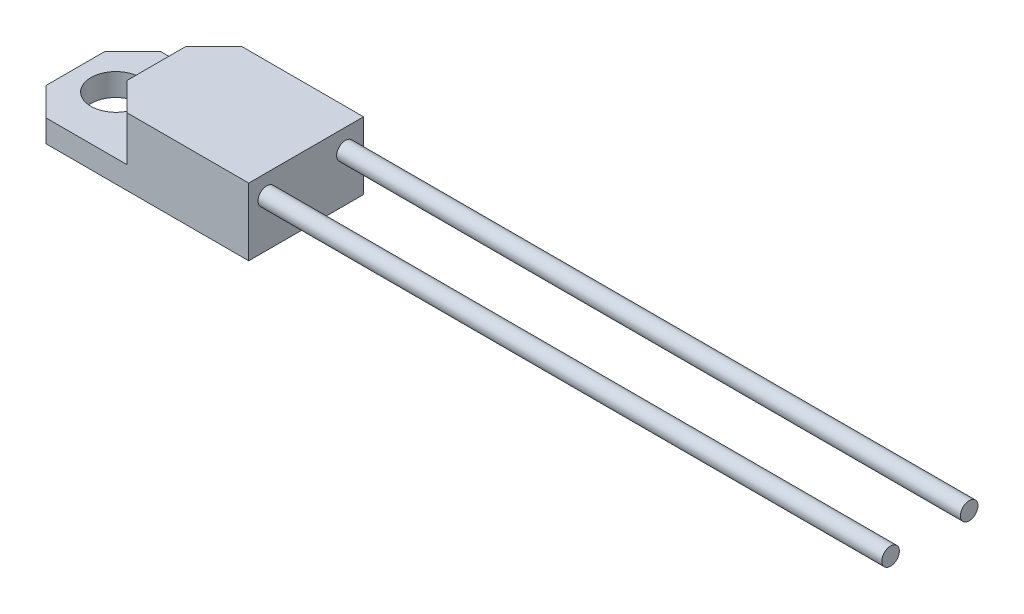
ISO-10303-21;
HEADER;
FILE_DESCRIPTION(('STEP AP214'),'2;1');
FILE_NAME('part.step','',(''),(''),'','','');
FILE_SCHEMA(('AUTOMOTIVE_DESIGN { 1 0 10303 214 1 1 1 1 }'));
ENDSEC;
DATA;
#1=APPLICATION_CONTEXT('core data for automotive mechanical design processes');
#2=APPLICATION_PROTOCOL_DEFINITION('international standard','automotive_design',2000,#1);
#3=PRODUCT_CONTEXT('',#1,'mechanical');
#4=PRODUCT('Part','Part','',(#3));
#5=PRODUCT_RELATED_PRODUCT_CATEGORY('part','',(#4));
#6=PRODUCT_DEFINITION_FORMATION('','',#4);
#7=PRODUCT_DEFINITION_CONTEXT('part definition',#1,'design');
#8=PRODUCT_DEFINITION('design','',#6,#7);
#9=PRODUCT_DEFINITION_SHAPE('','',#8);
#10=(LENGTH_UNIT() NAMED_UNIT(*) SI_UNIT(.MILLI.,.METRE.));
#11=(NAMED_UNIT(*) PLANE_ANGLE_UNIT() SI_UNIT($,.RADIAN.));
#12=(NAMED_UNIT(*) SI_UNIT($,.STERADIAN.) SOLID_ANGLE_UNIT());
#13=UNCERTAINTY_MEASURE_WITH_UNIT(LENGTH_MEASURE(1.E-05),#10,'distance_accuracy_value','');
#14=(GEOMETRIC_REPRESENTATION_CONTEXT(3) GLOBAL_UNCERTAINTY_ASSIGNED_CONTEXT((#13)) GLOBAL_UNIT_ASSIGNED_CONTEXT((#10,
#11,#12)) REPRESENTATION_CONTEXT('',''));
#15=CARTESIAN_POINT('',(0.,0.,0.));
#16=DIRECTION('',(0.,0.,1.));
#17=DIRECTION('',(1.,0.,0.));
#18=AXIS2_PLACEMENT_3D('',#15,#16,#17);
#19=CARTESIAN_POINT('',(9.25,1.8,4.6));
#20=DIRECTION('',(-1.,0.,0.));
#21=DIRECTION('',(0.,0.,1.));
#22=AXIS2_PLACEMENT_3D('',#19,#20,#21);
#23=PLANE('',#22);
#24=CARTESIAN_POINT('',(9.25,3.78,3.15));
#25=DIRECTION('',(-1.,0.,0.));
#26=DIRECTION('',(0.,0.,1.));
#27=AXIS2_PLACEMENT_3D('',#24,#25,#26);
#28=CIRCLE('',#27,0.705);
#29=CARTESIAN_POINT('',(9.25,3.78,3.855));
#30=VERTEX_POINT('',#29);
#31=EDGE_CURVE('E124',#30,#30,#28,.F.);
#32=ORIENTED_EDGE('',*,*,#31,.F.);
#33=EDGE_LOOP('',(#32));
#34=FACE_BOUND('',#33,.T.);
#35=DIRECTION('',(0.,0.,-1.));
#36=VECTOR('',#35,1.);
#37=CARTESIAN_POINT('',(9.25,0.,4.6));
#38=LINE('',#37,#36);
#39=CARTESIAN_POINT('',(9.25,0.,4.6));
#40=VERTEX_POINT('',#39);
#41=CARTESIAN_POINT('',(9.25,0.,-4.6));
#42=VERTEX_POINT('',#41);
#43=EDGE_CURVE('E121',#40,#42,#38,.T.);
#44=ORIENTED_EDGE('',*,*,#43,.T.);
#45=DIRECTION('',(0.,-1.,0.));
#46=VECTOR('',#45,1.);
#47=CARTESIAN_POINT('',(9.25,1.8,-4.6));
#48=LINE('',#47,#46);
#49=CARTESIAN_POINT('',(9.25,5.4,-4.6));
#50=VERTEX_POINT('',#49);
#51=EDGE_CURVE('E114',#50,#42,#48,.T.);
#52=ORIENTED_EDGE('',*,*,#51,.F.);
#53=DIRECTION('',(0.,0.,-1.));
#54=VECTOR('',#53,1.);
#55=CARTESIAN_POINT('',(9.25,5.4,-4.6));
#56=LINE('',#55,#54);
#57=CARTESIAN_POINT('',(9.25,5.4,4.6));
#58=VERTEX_POINT('',#57);
#59=EDGE_CURVE('E119',#58,#50,#56,.T.);
#60=ORIENTED_EDGE('',*,*,#59,.F.);
#61=DIRECTION('',(0.,-1.,0.));
#62=VECTOR('',#61,1.);
#63=CARTESIAN_POINT('',(9.25,1.8,4.6));
#64=LINE('',#63,#62);
#65=EDGE_CURVE('E125',#58,#40,#64,.T.);
#66=ORIENTED_EDGE('',*,*,#65,.T.);
#67=EDGE_LOOP('',(#44,#52,#60,#66));
#68=FACE_BOUND('',#67,.T.);
#69=CARTESIAN_POINT('',(9.25,3.78,-3.15));
#70=DIRECTION('',(-1.,0.,0.));
#71=DIRECTION('',(0.,0.,1.));
#72=AXIS2_PLACEMENT_3D('',#69,#70,#71);
#73=CIRCLE('',#72,0.705);
#74=CARTESIAN_POINT('',(9.25,3.78,-2.445));
#75=VERTEX_POINT('',#74);
#76=EDGE_CURVE('E157',#75,#75,#73,.F.);
#77=ORIENTED_EDGE('',*,*,#76,.F.);
#78=EDGE_LOOP('',(#77));
#79=FACE_BOUND('',#78,.T.);
#80=ADVANCED_FACE('F35',(#34,#68,#79),#23,.F.);
#81=CARTESIAN_POINT('',(9.25,1.8,-4.6));
#82=DIRECTION('',(0.,-1.,0.));
#83=DIRECTION('',(0.,0.,-1.));
#84=AXIS2_PLACEMENT_3D('',#81,#82,#83);
#85=PLANE('',#84);
#86=CARTESIAN_POINT('',(-6.,1.8,0.));
#87=DIRECTION('',(0.,1.,0.));
#88=DIRECTION('',(0.,0.,1.));
#89=AXIS2_PLACEMENT_3D('',#86,#87,#88);
#90=CIRCLE('',#89,2.);
#91=CARTESIAN_POINT('',(-6.,1.8,2.));
#92=VERTEX_POINT('',#91);
#93=EDGE_CURVE('E297',#92,#92,#90,.T.);
#94=ORIENTED_EDGE('',*,*,#93,.F.);
#95=EDGE_LOOP('',(#94));
#96=FACE_BOUND('',#95,.T.);
#97=DIRECTION('',(-1.,0.,0.));
#98=VECTOR('',#97,1.);
#99=CARTESIAN_POINT('',(-9.25,1.8,-4.6));
#100=LINE('',#99,#98);
#101=CARTESIAN_POINT('',(-0.499999999999999,1.8,-4.6));
#102=VERTEX_POINT('',#101);
#103=CARTESIAN_POINT('',(-6.99999999999998,1.8,-4.6));
#104=VERTEX_POINT('',#103);
#105=EDGE_CURVE('E186',#102,#104,#100,.T.);
#106=ORIENTED_EDGE('',*,*,#105,.T.);
#107=DIRECTION('',(0.707106781186549,0.,-0.707106781186546));
#108=VECTOR('',#107,1.);
#109=CARTESIAN_POINT('',(-9.25,1.8,-2.34999999999999));
#110=LINE('',#109,#108);
#111=CARTESIAN_POINT('',(-9.25,1.8,-2.34999999999999));
#112=VERTEX_POINT('',#111);
#113=EDGE_CURVE('E57',#104,#112,#110,.F.);
#114=ORIENTED_EDGE('',*,*,#113,.T.);
#115=DIRECTION('',(0.,0.,1.));
#116=VECTOR('',#115,1.);
#117=CARTESIAN_POINT('',(-9.25,1.8,4.6));
#118=LINE('',#117,#116);
#119=CARTESIAN_POINT('',(-9.25,1.8,2.34999999999999));
#120=VERTEX_POINT('',#119);
#121=EDGE_CURVE('E175',#112,#120,#118,.T.);
#122=ORIENTED_EDGE('',*,*,#121,.T.);
#123=DIRECTION('',(-0.707106781186545,0.,-0.70710678118655));
#124=VECTOR('',#123,1.);
#125=CARTESIAN_POINT('',(-7.,1.8,4.6));
#126=LINE('',#125,#124);
#127=CARTESIAN_POINT('',(-7.,1.8,4.6));
#128=VERTEX_POINT('',#127);
#129=EDGE_CURVE('E226',#120,#128,#126,.F.);
#130=ORIENTED_EDGE('',*,*,#129,.T.);
#131=DIRECTION('',(1.,0.,0.));
#132=VECTOR('',#131,1.);
#133=CARTESIAN_POINT('',(-9.25,1.8,4.6));
#134=LINE('',#133,#132);
#135=CARTESIAN_POINT('',(-0.499999999999992,1.8,4.6));
#136=VERTEX_POINT('',#135);
#137=EDGE_CURVE('E172',#128,#136,#134,.T.);
#138=ORIENTED_EDGE('',*,*,#137,.T.);
#139=DIRECTION('',(0.707106781186546,0.,0.707106781186549));
#140=VECTOR('',#139,1.);
#141=CARTESIAN_POINT('',(-0.225000000000013,1.8,4.87499999999998));
#142=LINE('',#141,#140);
#143=CARTESIAN_POINT('',(-2.75,1.8,2.34999999999998));
#144=VERTEX_POINT('',#143);
#145=EDGE_CURVE('E11',#136,#144,#142,.F.);
#146=ORIENTED_EDGE('',*,*,#145,.T.);
#147=DIRECTION('',(0.,0.,1.));
#148=VECTOR('',#147,1.);
#149=CARTESIAN_POINT('',(-2.75,1.8,-4.6));
#150=LINE('',#149,#148);
#151=CARTESIAN_POINT('',(-2.75,1.8,-2.35));
#152=VERTEX_POINT('',#151);
#153=EDGE_CURVE('E140',#152,#144,#150,.T.);
#154=ORIENTED_EDGE('',*,*,#153,.F.);
#155=DIRECTION('',(-0.707106781186548,0.,0.707106781186548));
#156=VECTOR('',#155,1.);
#157=CARTESIAN_POINT('',(4.375,1.8,-9.475));
#158=LINE('',#157,#156);
#159=EDGE_CURVE('E43',#152,#102,#158,.F.);
#160=ORIENTED_EDGE('',*,*,#159,.T.);
#161=EDGE_LOOP('',(#106,#114,#122,#130,#138,#146,#154,#160));
#162=FACE_BOUND('',#161,.T.);
#163=ADVANCED_FACE('F196',(#96,#162),#85,.F.);
#164=CARTESIAN_POINT('',(-9.25,1.8,-4.6));
#165=DIRECTION('',(0.,0.,1.));
#166=DIRECTION('',(1.,0.,0.));
#167=AXIS2_PLACEMENT_3D('',#164,#165,#166);
#168=PLANE('',#167);
#169=ORIENTED_EDGE('',*,*,#105,.F.);
#170=DIRECTION('',(0.,1.,0.));
#171=VECTOR('',#170,1.);
#172=CARTESIAN_POINT('',(-0.499999999999999,1.8,-4.6));
#173=LINE('',#172,#171);
#174=CARTESIAN_POINT('',(-0.499999999999996,5.4,-4.6));
#175=VERTEX_POINT('',#174);
#176=EDGE_CURVE('E131',#102,#175,#173,.T.);
#177=ORIENTED_EDGE('',*,*,#176,.T.);
#178=DIRECTION('',(-1.,0.,0.));
#179=VECTOR('',#178,1.);
#180=CARTESIAN_POINT('',(9.25,5.4,-4.6));
#181=LINE('',#180,#179);
#182=EDGE_CURVE('E128',#50,#175,#181,.T.);
#183=ORIENTED_EDGE('',*,*,#182,.F.);
#184=ORIENTED_EDGE('',*,*,#51,.T.);
#185=DIRECTION('',(-1.,0.,0.));
#186=VECTOR('',#185,1.);
#187=CARTESIAN_POINT('',(-9.25,0.,-4.6));
#188=LINE('',#187,#186);
#189=CARTESIAN_POINT('',(-6.99999999999998,0.,-4.6));
#190=VERTEX_POINT('',#189);
#191=EDGE_CURVE('E180',#42,#190,#188,.T.);
#192=ORIENTED_EDGE('',*,*,#191,.T.);
#193=DIRECTION('',(0.,1.,0.));
#194=VECTOR('',#193,1.);
#195=CARTESIAN_POINT('',(-6.99999999999998,1.8,-4.6));
#196=LINE('',#195,#194);
#197=EDGE_CURVE('E164',#190,#104,#196,.T.);
#198=ORIENTED_EDGE('',*,*,#197,.T.);
#199=EDGE_LOOP('',(#169,#177,#183,#184,#192,#198));
#200=FACE_BOUND('',#199,.T.);
#201=ADVANCED_FACE('F129',(#200),#168,.F.);
#202=CARTESIAN_POINT('',(-9.25,1.8,4.6));
#203=DIRECTION('',(1.,0.,0.));
#204=DIRECTION('',(0.,0.,-1.));
#205=AXIS2_PLACEMENT_3D('',#202,#203,#204);
#206=PLANE('',#205);
#207=ORIENTED_EDGE('',*,*,#121,.F.);
#208=DIRECTION('',(0.,-1.,0.));
#209=VECTOR('',#208,1.);
#210=CARTESIAN_POINT('',(-9.25,1.8,-2.34999999999999));
#211=LINE('',#210,#209);
#212=CARTESIAN_POINT('',(-9.25,0.,-2.35));
#213=VERTEX_POINT('',#212);
#214=EDGE_CURVE('E225',#112,#213,#211,.T.);
#215=ORIENTED_EDGE('',*,*,#214,.T.);
#216=DIRECTION('',(0.,0.,1.));
#217=VECTOR('',#216,1.);
#218=CARTESIAN_POINT('',(-9.25,0.,4.6));
#219=LINE('',#218,#217);
#220=CARTESIAN_POINT('',(-9.25,0.,2.34999999999999));
#221=VERTEX_POINT('',#220);
#222=EDGE_CURVE('E182',#213,#221,#219,.T.);
#223=ORIENTED_EDGE('',*,*,#222,.T.);
#224=DIRECTION('',(0.,1.,0.));
#225=VECTOR('',#224,1.);
#226=CARTESIAN_POINT('',(-9.25,1.8,2.34999999999999));
#227=LINE('',#226,#225);
#228=EDGE_CURVE('E50',#221,#120,#227,.T.);
#229=ORIENTED_EDGE('',*,*,#228,.T.);
#230=EDGE_LOOP('',(#207,#215,#223,#229));
#231=FACE_BOUND('',#230,.T.);
#232=ADVANCED_FACE('F257',(#231),#206,.F.);
#233=CARTESIAN_POINT('',(-9.25,1.8,4.6));
#234=DIRECTION('',(0.,0.,-1.));
#235=DIRECTION('',(-1.,0.,0.));
#236=AXIS2_PLACEMENT_3D('',#233,#234,#235);
#237=PLANE('',#236);
#238=DIRECTION('',(1.,0.,0.));
#239=VECTOR('',#238,1.);
#240=CARTESIAN_POINT('',(9.25,5.4,4.6));
#241=LINE('',#240,#239);
#242=CARTESIAN_POINT('',(-0.49999999999999,5.4,4.6));
#243=VERTEX_POINT('',#242);
#244=EDGE_CURVE('E138',#243,#58,#241,.T.);
#245=ORIENTED_EDGE('',*,*,#244,.F.);
#246=DIRECTION('',(0.,-1.,0.));
#247=VECTOR('',#246,1.);
#248=CARTESIAN_POINT('',(-0.499999999999992,1.8,4.6));
#249=LINE('',#248,#247);
#250=EDGE_CURVE('E236',#243,#136,#249,.T.);
#251=ORIENTED_EDGE('',*,*,#250,.T.);
#252=ORIENTED_EDGE('',*,*,#137,.F.);
#253=DIRECTION('',(0.,-1.,0.));
#254=VECTOR('',#253,1.);
#255=CARTESIAN_POINT('',(-7.,1.8,4.6));
#256=LINE('',#255,#254);
#257=CARTESIAN_POINT('',(-7.,0.,4.6));
#258=VERTEX_POINT('',#257);
#259=EDGE_CURVE('E171',#128,#258,#256,.T.);
#260=ORIENTED_EDGE('',*,*,#259,.T.);
#261=DIRECTION('',(1.,0.,0.));
#262=VECTOR('',#261,1.);
#263=CARTESIAN_POINT('',(-9.25,0.,4.6));
#264=LINE('',#263,#262);
#265=EDGE_CURVE('E184',#258,#40,#264,.T.);
#266=ORIENTED_EDGE('',*,*,#265,.T.);
#267=ORIENTED_EDGE('',*,*,#65,.F.);
#268=EDGE_LOOP('',(#245,#251,#252,#260,#266,#267));
#269=FACE_BOUND('',#268,.T.);
#270=ADVANCED_FACE('F244',(#269),#237,.F.);
#271=CARTESIAN_POINT('',(9.25,0.,-4.6));
#272=DIRECTION('',(0.,-1.,0.));
#273=DIRECTION('',(0.,0.,-1.));
#274=AXIS2_PLACEMENT_3D('',#271,#272,#273);
#275=PLANE('',#274);
#276=CARTESIAN_POINT('',(-6.,0.,0.));
#277=DIRECTION('',(0.,1.,0.));
#278=DIRECTION('',(0.,0.,1.));
#279=AXIS2_PLACEMENT_3D('',#276,#277,#278);
#280=CIRCLE('',#279,2.);
#281=CARTESIAN_POINT('',(-6.,0.,2.));
#282=VERTEX_POINT('',#281);
#283=EDGE_CURVE('E294',#282,#282,#280,.T.);
#284=ORIENTED_EDGE('',*,*,#283,.T.);
#285=EDGE_LOOP('',(#284));
#286=FACE_BOUND('',#285,.T.);
#287=ORIENTED_EDGE('',*,*,#222,.F.);
#288=DIRECTION('',(-0.707106781186549,0.,0.707106781186546));
#289=VECTOR('',#288,1.);
#290=CARTESIAN_POINT('',(1.12500000000003,0.,-12.725));
#291=LINE('',#290,#289);
#292=EDGE_CURVE('E229',#213,#190,#291,.F.);
#293=ORIENTED_EDGE('',*,*,#292,.T.);
#294=ORIENTED_EDGE('',*,*,#191,.F.);
#295=ORIENTED_EDGE('',*,*,#43,.F.);
#296=ORIENTED_EDGE('',*,*,#265,.F.);
#297=DIRECTION('',(0.707106781186545,0.,0.70710678118655));
#298=VECTOR('',#297,1.);
#299=CARTESIAN_POINT('',(-3.47500000000005,0.,8.12499999999997));
#300=LINE('',#299,#298);
#301=EDGE_CURVE('E233',#258,#221,#300,.F.);
#302=ORIENTED_EDGE('',*,*,#301,.T.);
#303=EDGE_LOOP('',(#287,#293,#294,#295,#296,#302));
#304=FACE_BOUND('',#303,.T.);
#305=ADVANCED_FACE('F248',(#286,#304),#275,.T.);
#306=CARTESIAN_POINT('',(-2.75,5.4,-4.6));
#307=DIRECTION('',(1.,0.,0.));
#308=DIRECTION('',(0.,0.,-1.));
#309=AXIS2_PLACEMENT_3D('',#306,#307,#308);
#310=PLANE('',#309);
#311=DIRECTION('',(0.,0.,1.));
#312=VECTOR('',#311,1.);
#313=CARTESIAN_POINT('',(-2.75,5.4,-4.6));
#314=LINE('',#313,#312);
#315=CARTESIAN_POINT('',(-2.75,5.4,-2.35));
#316=VERTEX_POINT('',#315);
#317=CARTESIAN_POINT('',(-2.75,5.4,2.34999999999998));
#318=VERTEX_POINT('',#317);
#319=EDGE_CURVE('E134',#316,#318,#314,.T.);
#320=ORIENTED_EDGE('',*,*,#319,.F.);
#321=DIRECTION('',(0.,-1.,0.));
#322=VECTOR('',#321,1.);
#323=CARTESIAN_POINT('',(-2.75,5.4,-2.35));
#324=LINE('',#323,#322);
#325=EDGE_CURVE('E161',#316,#152,#324,.T.);
#326=ORIENTED_EDGE('',*,*,#325,.T.);
#327=ORIENTED_EDGE('',*,*,#153,.T.);
#328=DIRECTION('',(0.,1.,0.));
#329=VECTOR('',#328,1.);
#330=CARTESIAN_POINT('',(-2.75,5.4,2.34999999999998));
#331=LINE('',#330,#329);
#332=EDGE_CURVE('E159',#144,#318,#331,.T.);
#333=ORIENTED_EDGE('',*,*,#332,.T.);
#334=EDGE_LOOP('',(#320,#326,#327,#333));
#335=FACE_BOUND('',#334,.T.);
#336=ADVANCED_FACE('F254',(#335),#310,.F.);
#337=CARTESIAN_POINT('',(9.25,5.4,4.6));
#338=DIRECTION('',(0.,-1.,0.));
#339=DIRECTION('',(0.,0.,-1.));
#340=AXIS2_PLACEMENT_3D('',#337,#338,#339);
#341=PLANE('',#340);
#342=ORIENTED_EDGE('',*,*,#182,.T.);
#343=DIRECTION('',(0.707106781186548,0.,-0.707106781186548));
#344=VECTOR('',#343,1.);
#345=CARTESIAN_POINT('',(-2.75,5.4,-2.35));
#346=LINE('',#345,#344);
#347=EDGE_CURVE('E169',#175,#316,#346,.F.);
#348=ORIENTED_EDGE('',*,*,#347,.T.);
#349=ORIENTED_EDGE('',*,*,#319,.T.);
#350=DIRECTION('',(-0.707106781186546,0.,-0.707106781186549));
#351=VECTOR('',#350,1.);
#352=CARTESIAN_POINT('',(-0.499999999999992,5.4,4.6));
#353=LINE('',#352,#351);
#354=EDGE_CURVE('E167',#318,#243,#353,.F.);
#355=ORIENTED_EDGE('',*,*,#354,.T.);
#356=ORIENTED_EDGE('',*,*,#244,.T.);
#357=ORIENTED_EDGE('',*,*,#59,.T.);
#358=EDGE_LOOP('',(#342,#348,#349,#355,#356,#357));
#359=FACE_BOUND('',#358,.T.);
#360=ADVANCED_FACE('F136',(#359),#341,.F.);
#361=CARTESIAN_POINT('',(59.25,3.78,3.15));
#362=DIRECTION('',(-1.,0.,0.));
#363=DIRECTION('',(0.,0.,1.));
#364=AXIS2_PLACEMENT_3D('',#361,#362,#363);
#365=CYLINDRICAL_SURFACE('',#364,0.705);
#366=CARTESIAN_POINT('',(59.25,3.78,3.15));
#367=DIRECTION('',(1.,0.,0.));
#368=DIRECTION('',(0.,0.,-1.));
#369=AXIS2_PLACEMENT_3D('',#366,#367,#368);
#370=CIRCLE('',#369,0.705);
#371=CARTESIAN_POINT('',(59.25,3.78,2.445));
#372=VERTEX_POINT('',#371);
#373=EDGE_CURVE('E143',#372,#372,#370,.T.);
#374=ORIENTED_EDGE('',*,*,#373,.F.);
#375=EDGE_LOOP('',(#374));
#376=FACE_BOUND('',#375,.T.);
#377=ORIENTED_EDGE('',*,*,#31,.T.);
#378=EDGE_LOOP('',(#377));
#379=FACE_BOUND('',#378,.T.);
#380=ADVANCED_FACE('F272',(#376,#379),#365,.T.);
#381=CARTESIAN_POINT('',(59.25,3.78,3.15));
#382=DIRECTION('',(1.,0.,0.));
#383=DIRECTION('',(0.,0.,-1.));
#384=AXIS2_PLACEMENT_3D('',#381,#382,#383);
#385=PLANE('',#384);
#386=ORIENTED_EDGE('',*,*,#373,.T.);
#387=EDGE_LOOP('',(#386));
#388=FACE_BOUND('',#387,.T.);
#389=ADVANCED_FACE('F275',(#388),#385,.T.);
#390=CARTESIAN_POINT('',(59.25,3.78,-3.15));
#391=DIRECTION('',(-1.,0.,0.));
#392=DIRECTION('',(0.,0.,1.));
#393=AXIS2_PLACEMENT_3D('',#390,#391,#392);
#394=CYLINDRICAL_SURFACE('',#393,0.705);
#395=CARTESIAN_POINT('',(59.25,3.78,-3.15));
#396=DIRECTION('',(1.,0.,0.));
#397=DIRECTION('',(0.,0.,-1.));
#398=AXIS2_PLACEMENT_3D('',#395,#396,#397);
#399=CIRCLE('',#398,0.705);
#400=CARTESIAN_POINT('',(59.25,3.78,-3.855));
#401=VERTEX_POINT('',#400);
#402=EDGE_CURVE('E299',#401,#401,#399,.T.);
#403=ORIENTED_EDGE('',*,*,#402,.F.);
#404=EDGE_LOOP('',(#403));
#405=FACE_BOUND('',#404,.T.);
#406=ORIENTED_EDGE('',*,*,#76,.T.);
#407=EDGE_LOOP('',(#406));
#408=FACE_BOUND('',#407,.T.);
#409=ADVANCED_FACE('F194',(#405,#408),#394,.T.);
#410=CARTESIAN_POINT('',(59.25,3.78,-3.15));
#411=DIRECTION('',(1.,0.,0.));
#412=DIRECTION('',(0.,0.,-1.));
#413=AXIS2_PLACEMENT_3D('',#410,#411,#412);
#414=PLANE('',#413);
#415=ORIENTED_EDGE('',*,*,#402,.T.);
#416=EDGE_LOOP('',(#415));
#417=FACE_BOUND('',#416,.T.);
#418=ADVANCED_FACE('F282',(#417),#414,.T.);
#419=CARTESIAN_POINT('',(-6.,0.,0.));
#420=DIRECTION('',(0.,1.,0.));
#421=DIRECTION('',(0.,0.,1.));
#422=AXIS2_PLACEMENT_3D('',#419,#420,#421);
#423=CYLINDRICAL_SURFACE('',#422,2.);
#424=ORIENTED_EDGE('',*,*,#283,.F.);
#425=EDGE_LOOP('',(#424));
#426=FACE_BOUND('',#425,.T.);
#427=ORIENTED_EDGE('',*,*,#93,.T.);
#428=EDGE_LOOP('',(#427));
#429=FACE_BOUND('',#428,.T.);
#430=ADVANCED_FACE('F211',(#426,#429),#423,.F.);
#431=CARTESIAN_POINT('',(-2.75,5.4,-2.35));
#432=DIRECTION('',(0.707106781186548,0.,0.707106781186548));
#433=DIRECTION('',(0.707106781186548,0.,-0.707106781186548));
#434=AXIS2_PLACEMENT_3D('',#431,#432,#433);
#435=PLANE('',#434);
#436=ORIENTED_EDGE('',*,*,#347,.F.);
#437=ORIENTED_EDGE('',*,*,#176,.F.);
#438=ORIENTED_EDGE('',*,*,#159,.F.);
#439=ORIENTED_EDGE('',*,*,#325,.F.);
#440=EDGE_LOOP('',(#436,#437,#438,#439));
#441=FACE_BOUND('',#440,.T.);
#442=ADVANCED_FACE('F207',(#441),#435,.F.);
#443=CARTESIAN_POINT('',(-0.499999999999992,1.8,4.6));
#444=DIRECTION('',(0.707106781186549,0.,-0.707106781186546));
#445=DIRECTION('',(-0.707106781186546,0.,-0.707106781186549));
#446=AXIS2_PLACEMENT_3D('',#443,#444,#445);
#447=PLANE('',#446);
#448=ORIENTED_EDGE('',*,*,#354,.F.);
#449=ORIENTED_EDGE('',*,*,#332,.F.);
#450=ORIENTED_EDGE('',*,*,#145,.F.);
#451=ORIENTED_EDGE('',*,*,#250,.F.);
#452=EDGE_LOOP('',(#448,#449,#450,#451));
#453=FACE_BOUND('',#452,.T.);
#454=ADVANCED_FACE('F210',(#453),#447,.F.);
#455=CARTESIAN_POINT('',(-9.25,1.8,-2.34999999999999));
#456=DIRECTION('',(0.707106781186547,0.,0.707106781186549));
#457=DIRECTION('',(0.707106781186549,0.,-0.707106781186546));
#458=AXIS2_PLACEMENT_3D('',#455,#456,#457);
#459=PLANE('',#458);
#460=ORIENTED_EDGE('',*,*,#113,.F.);
#461=ORIENTED_EDGE('',*,*,#197,.F.);
#462=ORIENTED_EDGE('',*,*,#292,.F.);
#463=ORIENTED_EDGE('',*,*,#214,.F.);
#464=EDGE_LOOP('',(#460,#461,#462,#463));
#465=FACE_BOUND('',#464,.T.);
#466=ADVANCED_FACE('F214',(#465),#459,.F.);
#467=CARTESIAN_POINT('',(-7.,1.8,4.6));
#468=DIRECTION('',(0.70710678118655,0.,-0.707106781186545));
#469=DIRECTION('',(-0.707106781186545,0.,-0.70710678118655));
#470=AXIS2_PLACEMENT_3D('',#467,#468,#469);
#471=PLANE('',#470);
#472=ORIENTED_EDGE('',*,*,#129,.F.);
#473=ORIENTED_EDGE('',*,*,#228,.F.);
#474=ORIENTED_EDGE('',*,*,#301,.F.);
#475=ORIENTED_EDGE('',*,*,#259,.F.);
#476=EDGE_LOOP('',(#472,#473,#474,#475));
#477=FACE_BOUND('',#476,.T.);
#478=ADVANCED_FACE('F37',(#477),#471,.F.);
#479=CLOSED_SHELL('',(#80,#163,#201,#232,#270,#305,#336,#360,#380,#389,#409,#418,#430,#442,#454,
#466,#478));
#480=MANIFOLD_SOLID_BREP('B2',#479);
#481=ADVANCED_BREP_SHAPE_REPRESENTATION('',(#18,#480),#14);
#482=SHAPE_DEFINITION_REPRESENTATION(#9,#481);
ENDSEC;
END-ISO-10303-21;
